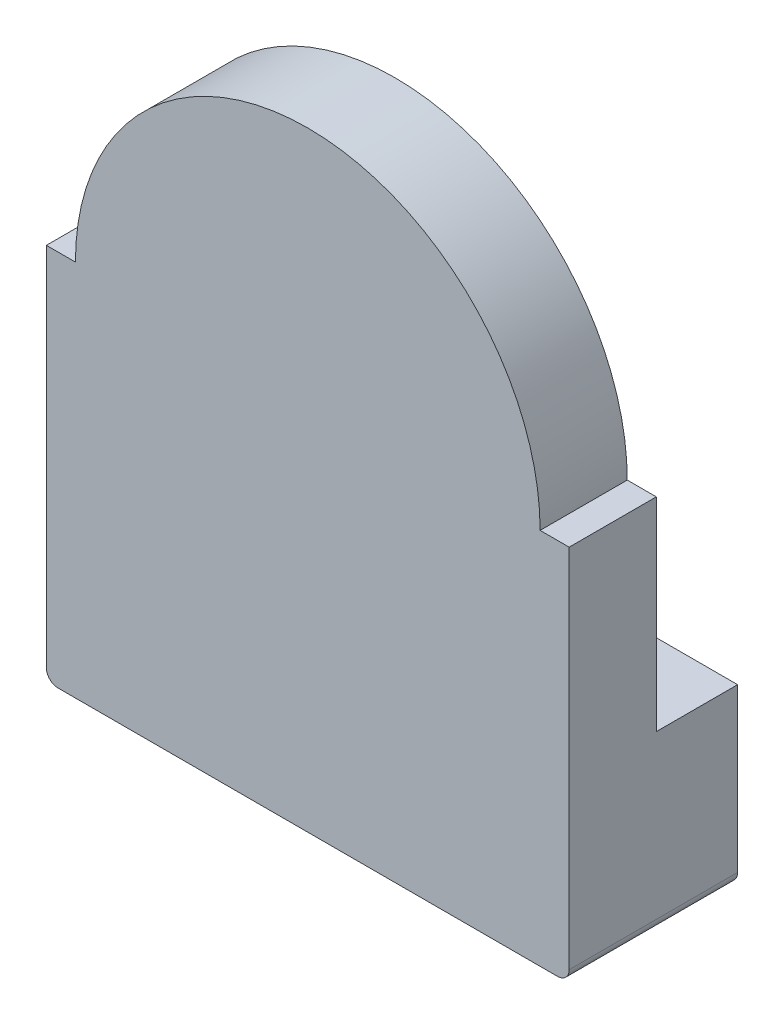
ISO-10303-21;
HEADER;
FILE_DESCRIPTION(('STEP AP214'),'2;1');
FILE_NAME('part.step','',(''),(''),'','','');
FILE_SCHEMA(('AUTOMOTIVE_DESIGN { 1 0 10303 214 1 1 1 1 }'));
ENDSEC;
DATA;
#1=APPLICATION_CONTEXT('core data for automotive mechanical design processes');
#2=APPLICATION_PROTOCOL_DEFINITION('international standard','automotive_design',2000,#1);
#3=PRODUCT_CONTEXT('',#1,'mechanical');
#4=PRODUCT('Part','Part','',(#3));
#5=PRODUCT_RELATED_PRODUCT_CATEGORY('part','',(#4));
#6=PRODUCT_DEFINITION_FORMATION('','',#4);
#7=PRODUCT_DEFINITION_CONTEXT('part definition',#1,'design');
#8=PRODUCT_DEFINITION('design','',#6,#7);
#9=PRODUCT_DEFINITION_SHAPE('','',#8);
#10=(LENGTH_UNIT() NAMED_UNIT(*) SI_UNIT(.MILLI.,.METRE.));
#11=(NAMED_UNIT(*) PLANE_ANGLE_UNIT() SI_UNIT($,.RADIAN.));
#12=(NAMED_UNIT(*) SI_UNIT($,.STERADIAN.) SOLID_ANGLE_UNIT());
#13=UNCERTAINTY_MEASURE_WITH_UNIT(LENGTH_MEASURE(1.E-05),#10,'distance_accuracy_value','');
#14=(GEOMETRIC_REPRESENTATION_CONTEXT(3) GLOBAL_UNCERTAINTY_ASSIGNED_CONTEXT((#13)) GLOBAL_UNIT_ASSIGNED_CONTEXT((#10,
#11,#12)) REPRESENTATION_CONTEXT('',''));
#15=CARTESIAN_POINT('',(0.,0.,0.));
#16=DIRECTION('',(0.,0.,1.));
#17=DIRECTION('',(1.,0.,0.));
#18=AXIS2_PLACEMENT_3D('',#15,#16,#17);
#19=CARTESIAN_POINT('',(1.5,3.,-13.4));
#20=DIRECTION('',(0.,1.,0.));
#21=DIRECTION('',(0.,0.,1.));
#22=AXIS2_PLACEMENT_3D('',#19,#20,#21);
#23=PLANE('',#22);
#24=DIRECTION('',(0.,0.,-1.));
#25=VECTOR('',#24,1.);
#26=CARTESIAN_POINT('',(1.5,3.,-13.4));
#27=LINE('',#26,#25);
#28=CARTESIAN_POINT('',(1.5,3.,-14.8));
#29=VERTEX_POINT('',#28);
#30=CARTESIAN_POINT('',(1.5,3.,-13.4));
#31=VERTEX_POINT('',#30);
#32=EDGE_CURVE('E195',#29,#31,#27,.F.);
#33=ORIENTED_EDGE('',*,*,#32,.T.);
#34=DIRECTION('',(-1.,0.,0.));
#35=VECTOR('',#34,1.);
#36=CARTESIAN_POINT('',(0.,3.,-13.4));
#37=LINE('',#36,#35);
#38=CARTESIAN_POINT('',(4.5,3.,-13.4));
#39=VERTEX_POINT('',#38);
#40=EDGE_CURVE('E122',#39,#31,#37,.T.);
#41=ORIENTED_EDGE('',*,*,#40,.F.);
#42=DIRECTION('',(0.,0.,1.));
#43=VECTOR('',#42,1.);
#44=CARTESIAN_POINT('',(4.5,3.,-13.4));
#45=LINE('',#44,#43);
#46=CARTESIAN_POINT('',(4.5,3.,-14.8));
#47=VERTEX_POINT('',#46);
#48=EDGE_CURVE('E131',#39,#47,#45,.F.);
#49=ORIENTED_EDGE('',*,*,#48,.T.);
#50=DIRECTION('',(-1.,0.,0.));
#51=VECTOR('',#50,1.);
#52=CARTESIAN_POINT('',(1.5,3.,-14.8));
#53=LINE('',#52,#51);
#54=EDGE_CURVE('E162',#29,#47,#53,.F.);
#55=ORIENTED_EDGE('',*,*,#54,.F.);
#56=EDGE_LOOP('',(#33,#41,#49,#55));
#57=FACE_BOUND('',#56,.T.);
#58=ADVANCED_FACE('F17',(#57),#23,.T.);
#59=CARTESIAN_POINT('',(1.5,0.,-13.4));
#60=DIRECTION('',(1.,0.,0.));
#61=DIRECTION('',(0.,0.,-1.));
#62=AXIS2_PLACEMENT_3D('',#59,#60,#61);
#63=PLANE('',#62);
#64=ORIENTED_EDGE('',*,*,#32,.F.);
#65=DIRECTION('',(0.,1.,0.));
#66=VECTOR('',#65,1.);
#67=CARTESIAN_POINT('',(1.5,3.,-14.8));
#68=LINE('',#67,#66);
#69=CARTESIAN_POINT('',(1.5,0.,-14.8));
#70=VERTEX_POINT('',#69);
#71=EDGE_CURVE('E180',#70,#29,#68,.T.);
#72=ORIENTED_EDGE('',*,*,#71,.F.);
#73=DIRECTION('',(0.,0.,-1.));
#74=VECTOR('',#73,1.);
#75=CARTESIAN_POINT('',(1.5,0.,-13.4));
#76=LINE('',#75,#74);
#77=CARTESIAN_POINT('',(1.5,0.,-13.4));
#78=VERTEX_POINT('',#77);
#79=EDGE_CURVE('E200',#78,#70,#76,.T.);
#80=ORIENTED_EDGE('',*,*,#79,.F.);
#81=DIRECTION('',(0.,1.,0.));
#82=VECTOR('',#81,1.);
#83=CARTESIAN_POINT('',(1.5,6.5,-13.4));
#84=LINE('',#83,#82);
#85=EDGE_CURVE('E147',#31,#78,#84,.F.);
#86=ORIENTED_EDGE('',*,*,#85,.F.);
#87=EDGE_LOOP('',(#64,#72,#80,#86));
#88=FACE_BOUND('',#87,.T.);
#89=ADVANCED_FACE('F246',(#88),#63,.F.);
#90=CARTESIAN_POINT('',(4.,6.5,-13.4));
#91=DIRECTION('',(0.,-1.,0.));
#92=DIRECTION('',(1.,0.,0.));
#93=AXIS2_PLACEMENT_3D('',#90,#91,#92);
#94=PLANE('',#93);
#95=DIRECTION('',(0.,0.,1.));
#96=VECTOR('',#95,1.);
#97=CARTESIAN_POINT('',(4.5,6.5,-13.4));
#98=LINE('',#97,#96);
#99=CARTESIAN_POINT('',(4.5,6.5,-11.9));
#100=VERTEX_POINT('',#99);
#101=CARTESIAN_POINT('',(4.5,6.5,-13.4));
#102=VERTEX_POINT('',#101);
#103=EDGE_CURVE('E129',#100,#102,#98,.F.);
#104=ORIENTED_EDGE('',*,*,#103,.T.);
#105=DIRECTION('',(-1.,0.,0.));
#106=VECTOR('',#105,1.);
#107=CARTESIAN_POINT('',(0.,6.5,-13.4));
#108=LINE('',#107,#106);
#109=CARTESIAN_POINT('',(4.,6.5,-13.4));
#110=VERTEX_POINT('',#109);
#111=EDGE_CURVE('E116',#110,#102,#108,.F.);
#112=ORIENTED_EDGE('',*,*,#111,.F.);
#113=DIRECTION('',(0.,0.,-1.));
#114=VECTOR('',#113,1.);
#115=CARTESIAN_POINT('',(4.,6.5,-13.4));
#116=LINE('',#115,#114);
#117=CARTESIAN_POINT('',(4.,6.5,-11.9));
#118=VERTEX_POINT('',#117);
#119=EDGE_CURVE('E146',#118,#110,#116,.T.);
#120=ORIENTED_EDGE('',*,*,#119,.F.);
#121=DIRECTION('',(1.,0.,0.));
#122=VECTOR('',#121,1.);
#123=CARTESIAN_POINT('',(4.,6.5,-11.9));
#124=LINE('',#123,#122);
#125=EDGE_CURVE('E62',#100,#118,#124,.F.);
#126=ORIENTED_EDGE('',*,*,#125,.F.);
#127=EDGE_LOOP('',(#104,#112,#120,#126));
#128=FACE_BOUND('',#127,.T.);
#129=ADVANCED_FACE('F135',(#128),#94,.F.);
#130=CARTESIAN_POINT('',(4.3,0.199999999999999,-13.4));
#131=DIRECTION('',(0.,0.,-1.));
#132=DIRECTION('',(-1.,0.,0.));
#133=AXIS2_PLACEMENT_3D('',#130,#131,#132);
#134=CYLINDRICAL_SURFACE('',#133,0.2);
#135=CARTESIAN_POINT('',(4.3,0.199999999999999,-11.9));
#136=DIRECTION('',(0.,0.,-1.));
#137=DIRECTION('',(-1.,0.,0.));
#138=AXIS2_PLACEMENT_3D('',#135,#136,#137);
#139=CIRCLE('',#138,0.2);
#140=CARTESIAN_POINT('',(4.5,0.199999999999999,-11.9));
#141=VERTEX_POINT('',#140);
#142=CARTESIAN_POINT('',(4.3,0.,-11.9));
#143=VERTEX_POINT('',#142);
#144=EDGE_CURVE('E20',#141,#143,#139,.T.);
#145=ORIENTED_EDGE('',*,*,#144,.T.);
#146=DIRECTION('',(0.,0.,1.));
#147=VECTOR('',#146,1.);
#148=CARTESIAN_POINT('',(4.3,0.,-13.4));
#149=LINE('',#148,#147);
#150=CARTESIAN_POINT('',(4.3,0.,-14.8));
#151=VERTEX_POINT('',#150);
#152=EDGE_CURVE('E177',#143,#151,#149,.F.);
#153=ORIENTED_EDGE('',*,*,#152,.T.);
#154=CARTESIAN_POINT('',(4.3,0.199999999999999,-14.8));
#155=DIRECTION('',(0.,0.,-1.));
#156=DIRECTION('',(-1.,0.,0.));
#157=AXIS2_PLACEMENT_3D('',#154,#155,#156);
#158=CIRCLE('',#157,0.2);
#159=CARTESIAN_POINT('',(4.5,0.199999999999999,-14.8));
#160=VERTEX_POINT('',#159);
#161=EDGE_CURVE('E183',#160,#151,#158,.T.);
#162=ORIENTED_EDGE('',*,*,#161,.F.);
#163=DIRECTION('',(0.,0.,1.));
#164=VECTOR('',#163,1.);
#165=CARTESIAN_POINT('',(4.5,0.2,-13.4));
#166=LINE('',#165,#164);
#167=EDGE_CURVE('E142',#160,#141,#166,.T.);
#168=ORIENTED_EDGE('',*,*,#167,.T.);
#169=EDGE_LOOP('',(#145,#153,#162,#168));
#170=FACE_BOUND('',#169,.T.);
#171=ADVANCED_FACE('F224',(#170),#134,.T.);
#172=CARTESIAN_POINT('',(1.5,3.,-14.8));
#173=DIRECTION('',(0.,0.,-1.));
#174=DIRECTION('',(-1.,0.,0.));
#175=AXIS2_PLACEMENT_3D('',#172,#173,#174);
#176=PLANE('',#175);
#177=ORIENTED_EDGE('',*,*,#71,.T.);
#178=ORIENTED_EDGE('',*,*,#54,.T.);
#179=DIRECTION('',(0.,-1.,0.));
#180=VECTOR('',#179,1.);
#181=CARTESIAN_POINT('',(4.5,6.5,-14.8));
#182=LINE('',#181,#180);
#183=EDGE_CURVE('E133',#47,#160,#182,.T.);
#184=ORIENTED_EDGE('',*,*,#183,.T.);
#185=ORIENTED_EDGE('',*,*,#161,.T.);
#186=DIRECTION('',(1.,0.,0.));
#187=VECTOR('',#186,1.);
#188=CARTESIAN_POINT('',(4.5,0.,-14.8));
#189=LINE('',#188,#187);
#190=EDGE_CURVE('E168',#151,#70,#189,.F.);
#191=ORIENTED_EDGE('',*,*,#190,.T.);
#192=EDGE_LOOP('',(#177,#178,#184,#185,#191));
#193=FACE_BOUND('',#192,.T.);
#194=ADVANCED_FACE('F249',(#193),#176,.T.);
#195=CARTESIAN_POINT('',(-4.5,6.5,-13.4));
#196=DIRECTION('',(0.,-1.,0.));
#197=DIRECTION('',(0.,0.,-1.));
#198=AXIS2_PLACEMENT_3D('',#195,#196,#197);
#199=PLANE('',#198);
#200=DIRECTION('',(0.,0.,-1.));
#201=VECTOR('',#200,1.);
#202=CARTESIAN_POINT('',(-4.,6.5,-13.4));
#203=LINE('',#202,#201);
#204=CARTESIAN_POINT('',(-4.,6.5,-13.4));
#205=VERTEX_POINT('',#204);
#206=CARTESIAN_POINT('',(-4.,6.5,-11.9));
#207=VERTEX_POINT('',#206);
#208=EDGE_CURVE('E136',#205,#207,#203,.F.);
#209=ORIENTED_EDGE('',*,*,#208,.F.);
#210=DIRECTION('',(-1.,0.,0.));
#211=VECTOR('',#210,1.);
#212=CARTESIAN_POINT('',(0.,6.5,-13.4));
#213=LINE('',#212,#211);
#214=CARTESIAN_POINT('',(-4.5,6.5,-13.4));
#215=VERTEX_POINT('',#214);
#216=EDGE_CURVE('E123',#215,#205,#213,.F.);
#217=ORIENTED_EDGE('',*,*,#216,.F.);
#218=DIRECTION('',(0.,0.,1.));
#219=VECTOR('',#218,1.);
#220=CARTESIAN_POINT('',(-4.5,6.5,-13.4));
#221=LINE('',#220,#219);
#222=CARTESIAN_POINT('',(-4.5,6.5,-11.9));
#223=VERTEX_POINT('',#222);
#224=EDGE_CURVE('E109',#215,#223,#221,.T.);
#225=ORIENTED_EDGE('',*,*,#224,.T.);
#226=DIRECTION('',(1.,0.,0.));
#227=VECTOR('',#226,1.);
#228=CARTESIAN_POINT('',(-4.5,6.5,-11.9));
#229=LINE('',#228,#227);
#230=EDGE_CURVE('E160',#207,#223,#229,.F.);
#231=ORIENTED_EDGE('',*,*,#230,.F.);
#232=EDGE_LOOP('',(#209,#217,#225,#231));
#233=FACE_BOUND('',#232,.T.);
#234=ADVANCED_FACE('F251',(#233),#199,.F.);
#235=CARTESIAN_POINT('',(-4.3,0.199999999999999,-13.4));
#236=DIRECTION('',(0.,0.,-1.));
#237=DIRECTION('',(-1.,0.,0.));
#238=AXIS2_PLACEMENT_3D('',#235,#236,#237);
#239=CYLINDRICAL_SURFACE('',#238,0.2);
#240=CARTESIAN_POINT('',(-4.3,0.199999999999999,-11.9));
#241=DIRECTION('',(0.,0.,-1.));
#242=DIRECTION('',(-1.,0.,0.));
#243=AXIS2_PLACEMENT_3D('',#240,#241,#242);
#244=CIRCLE('',#243,0.2);
#245=CARTESIAN_POINT('',(-4.3,0.,-11.9));
#246=VERTEX_POINT('',#245);
#247=CARTESIAN_POINT('',(-4.5,0.199999999999999,-11.9));
#248=VERTEX_POINT('',#247);
#249=EDGE_CURVE('E35',#246,#248,#244,.T.);
#250=ORIENTED_EDGE('',*,*,#249,.T.);
#251=DIRECTION('',(0.,0.,1.));
#252=VECTOR('',#251,1.);
#253=CARTESIAN_POINT('',(-4.5,0.199999999999999,-13.4));
#254=LINE('',#253,#252);
#255=CARTESIAN_POINT('',(-4.5,0.199999999999999,-13.4));
#256=VERTEX_POINT('',#255);
#257=EDGE_CURVE('E157',#248,#256,#254,.F.);
#258=ORIENTED_EDGE('',*,*,#257,.T.);
#259=CARTESIAN_POINT('',(-4.3,0.199999999999999,-13.4));
#260=DIRECTION('',(0.,0.,-1.));
#261=DIRECTION('',(-1.,0.,0.));
#262=AXIS2_PLACEMENT_3D('',#259,#260,#261);
#263=CIRCLE('',#262,0.2);
#264=CARTESIAN_POINT('',(-4.3,0.,-13.4));
#265=VERTEX_POINT('',#264);
#266=EDGE_CURVE('E103',#265,#256,#263,.T.);
#267=ORIENTED_EDGE('',*,*,#266,.F.);
#268=DIRECTION('',(0.,0.,1.));
#269=VECTOR('',#268,1.);
#270=CARTESIAN_POINT('',(-4.3,0.,-13.4));
#271=LINE('',#270,#269);
#272=EDGE_CURVE('E167',#265,#246,#271,.T.);
#273=ORIENTED_EDGE('',*,*,#272,.T.);
#274=EDGE_LOOP('',(#250,#258,#267,#273));
#275=FACE_BOUND('',#274,.T.);
#276=ADVANCED_FACE('F242',(#275),#239,.T.);
#277=CARTESIAN_POINT('',(0.,6.5,-13.4));
#278=DIRECTION('',(0.,0.,-1.));
#279=DIRECTION('',(-1.,0.,0.));
#280=AXIS2_PLACEMENT_3D('',#277,#278,#279);
#281=PLANE('',#280);
#282=ORIENTED_EDGE('',*,*,#40,.T.);
#283=ORIENTED_EDGE('',*,*,#85,.T.);
#284=DIRECTION('',(1.,0.,0.));
#285=VECTOR('',#284,1.);
#286=CARTESIAN_POINT('',(4.5,0.,-13.4));
#287=LINE('',#286,#285);
#288=EDGE_CURVE('E165',#78,#265,#287,.F.);
#289=ORIENTED_EDGE('',*,*,#288,.T.);
#290=ORIENTED_EDGE('',*,*,#266,.T.);
#291=DIRECTION('',(0.,1.,0.));
#292=VECTOR('',#291,1.);
#293=CARTESIAN_POINT('',(-4.5,0.,-13.4));
#294=LINE('',#293,#292);
#295=EDGE_CURVE('E154',#256,#215,#294,.T.);
#296=ORIENTED_EDGE('',*,*,#295,.T.);
#297=ORIENTED_EDGE('',*,*,#216,.T.);
#298=CARTESIAN_POINT('',(0.,6.5,-13.4));
#299=DIRECTION('',(0.,0.,-1.));
#300=DIRECTION('',(-1.,0.,0.));
#301=AXIS2_PLACEMENT_3D('',#298,#299,#300);
#302=CIRCLE('',#301,4.);
#303=EDGE_CURVE('E121',#110,#205,#302,.F.);
#304=ORIENTED_EDGE('',*,*,#303,.F.);
#305=ORIENTED_EDGE('',*,*,#111,.T.);
#306=DIRECTION('',(0.,-1.,0.));
#307=VECTOR('',#306,1.);
#308=CARTESIAN_POINT('',(4.5,6.5,-13.4));
#309=LINE('',#308,#307);
#310=EDGE_CURVE('E119',#102,#39,#309,.T.);
#311=ORIENTED_EDGE('',*,*,#310,.T.);
#312=EDGE_LOOP('',(#282,#283,#289,#290,#296,#297,#304,#305,#311));
#313=FACE_BOUND('',#312,.T.);
#314=ADVANCED_FACE('F118',(#313),#281,.T.);
#315=CARTESIAN_POINT('',(0.,6.5,-13.4));
#316=DIRECTION('',(0.,0.,-1.));
#317=DIRECTION('',(-1.,0.,0.));
#318=AXIS2_PLACEMENT_3D('',#315,#316,#317);
#319=CYLINDRICAL_SURFACE('',#318,4.);
#320=ORIENTED_EDGE('',*,*,#303,.T.);
#321=ORIENTED_EDGE('',*,*,#208,.T.);
#322=CARTESIAN_POINT('',(0.,6.5,-11.9));
#323=DIRECTION('',(0.,0.,-1.));
#324=DIRECTION('',(-1.,0.,0.));
#325=AXIS2_PLACEMENT_3D('',#322,#323,#324);
#326=CIRCLE('',#325,4.);
#327=EDGE_CURVE('E156',#207,#118,#326,.T.);
#328=ORIENTED_EDGE('',*,*,#327,.T.);
#329=ORIENTED_EDGE('',*,*,#119,.T.);
#330=EDGE_LOOP('',(#320,#321,#328,#329));
#331=FACE_BOUND('',#330,.T.);
#332=ADVANCED_FACE('F273',(#331),#319,.T.);
#333=CARTESIAN_POINT('',(4.5,6.5,-13.4));
#334=DIRECTION('',(-1.,0.,0.));
#335=DIRECTION('',(0.,-1.,0.));
#336=AXIS2_PLACEMENT_3D('',#333,#334,#335);
#337=PLANE('',#336);
#338=ORIENTED_EDGE('',*,*,#167,.F.);
#339=ORIENTED_EDGE('',*,*,#183,.F.);
#340=ORIENTED_EDGE('',*,*,#48,.F.);
#341=ORIENTED_EDGE('',*,*,#310,.F.);
#342=ORIENTED_EDGE('',*,*,#103,.F.);
#343=DIRECTION('',(0.,1.,0.));
#344=VECTOR('',#343,1.);
#345=CARTESIAN_POINT('',(4.5,6.5,-11.9));
#346=LINE('',#345,#344);
#347=EDGE_CURVE('E216',#100,#141,#346,.F.);
#348=ORIENTED_EDGE('',*,*,#347,.T.);
#349=EDGE_LOOP('',(#338,#339,#340,#341,#342,#348));
#350=FACE_BOUND('',#349,.T.);
#351=ADVANCED_FACE('F127',(#350),#337,.F.);
#352=CARTESIAN_POINT('',(4.5,0.,-13.4));
#353=DIRECTION('',(0.,1.,0.));
#354=DIRECTION('',(0.,0.,1.));
#355=AXIS2_PLACEMENT_3D('',#352,#353,#354);
#356=PLANE('',#355);
#357=ORIENTED_EDGE('',*,*,#272,.F.);
#358=ORIENTED_EDGE('',*,*,#288,.F.);
#359=ORIENTED_EDGE('',*,*,#79,.T.);
#360=ORIENTED_EDGE('',*,*,#190,.F.);
#361=ORIENTED_EDGE('',*,*,#152,.F.);
#362=DIRECTION('',(-1.,0.,0.));
#363=VECTOR('',#362,1.);
#364=CARTESIAN_POINT('',(0.,0.,-11.9));
#365=LINE('',#364,#363);
#366=EDGE_CURVE('E26',#143,#246,#365,.T.);
#367=ORIENTED_EDGE('',*,*,#366,.T.);
#368=EDGE_LOOP('',(#357,#358,#359,#360,#361,#367));
#369=FACE_BOUND('',#368,.T.);
#370=ADVANCED_FACE('F228',(#369),#356,.F.);
#371=CARTESIAN_POINT('',(-4.5,0.,-13.4));
#372=DIRECTION('',(1.,0.,0.));
#373=DIRECTION('',(0.,1.,0.));
#374=AXIS2_PLACEMENT_3D('',#371,#372,#373);
#375=PLANE('',#374);
#376=ORIENTED_EDGE('',*,*,#257,.F.);
#377=DIRECTION('',(0.,1.,0.));
#378=VECTOR('',#377,1.);
#379=CARTESIAN_POINT('',(-4.5,6.5,-11.9));
#380=LINE('',#379,#378);
#381=EDGE_CURVE('E11',#248,#223,#380,.T.);
#382=ORIENTED_EDGE('',*,*,#381,.T.);
#383=ORIENTED_EDGE('',*,*,#224,.F.);
#384=ORIENTED_EDGE('',*,*,#295,.F.);
#385=EDGE_LOOP('',(#376,#382,#383,#384));
#386=FACE_BOUND('',#385,.T.);
#387=ADVANCED_FACE('F262',(#386),#375,.F.);
#388=CARTESIAN_POINT('',(0.,6.5,-11.9));
#389=DIRECTION('',(0.,0.,-1.));
#390=DIRECTION('',(-1.,0.,0.));
#391=AXIS2_PLACEMENT_3D('',#388,#389,#390);
#392=PLANE('',#391);
#393=ORIENTED_EDGE('',*,*,#249,.F.);
#394=ORIENTED_EDGE('',*,*,#366,.F.);
#395=ORIENTED_EDGE('',*,*,#144,.F.);
#396=ORIENTED_EDGE('',*,*,#347,.F.);
#397=ORIENTED_EDGE('',*,*,#125,.T.);
#398=ORIENTED_EDGE('',*,*,#327,.F.);
#399=ORIENTED_EDGE('',*,*,#230,.T.);
#400=ORIENTED_EDGE('',*,*,#381,.F.);
#401=EDGE_LOOP('',(#393,#394,#395,#396,#397,#398,#399,#400));
#402=FACE_BOUND('',#401,.T.);
#403=ADVANCED_FACE('F230',(#402),#392,.F.);
#404=CLOSED_SHELL('',(#58,#89,#129,#171,#194,#234,#276,#314,#332,#351,#370,#387,#403));
#405=MANIFOLD_SOLID_BREP('B1',#404);
#406=ADVANCED_BREP_SHAPE_REPRESENTATION('',(#18,#405),#14);
#407=SHAPE_DEFINITION_REPRESENTATION(#9,#406);
ENDSEC;
END-ISO-10303-21;
